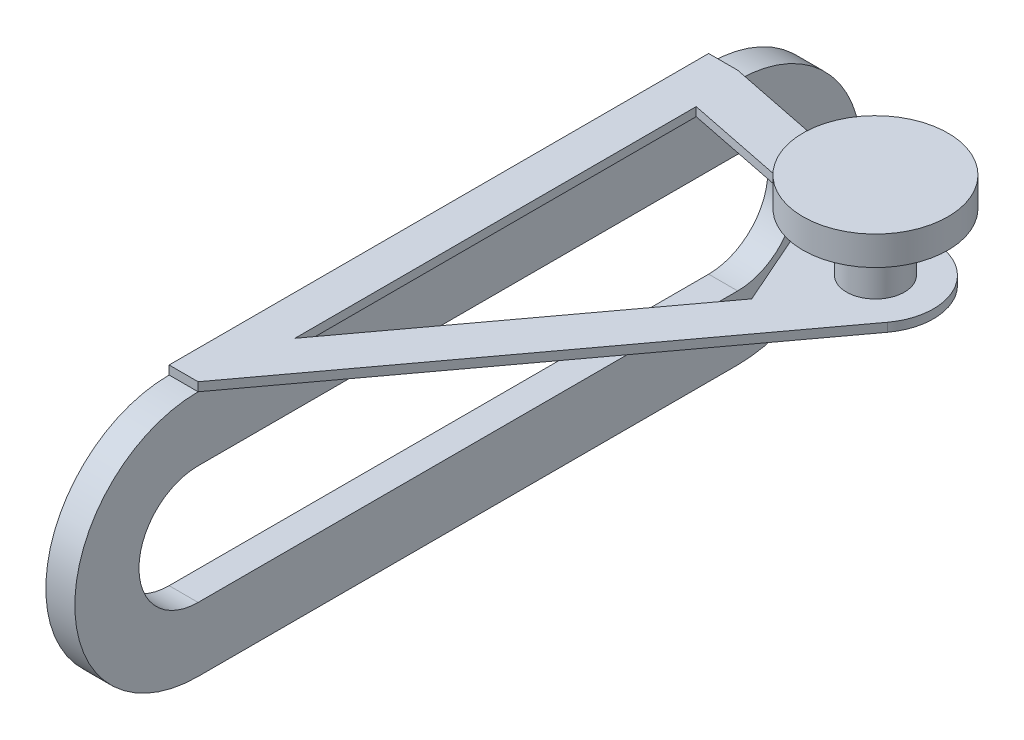
ISO-10303-21;
HEADER;
FILE_DESCRIPTION(('STEP AP214'),'2;1');
FILE_NAME('part.step','',(''),(''),'','','');
FILE_SCHEMA(('AUTOMOTIVE_DESIGN { 1 0 10303 214 1 1 1 1 }'));
ENDSEC;
DATA;
#1=APPLICATION_CONTEXT('core data for automotive mechanical design processes');
#2=APPLICATION_PROTOCOL_DEFINITION('international standard','automotive_design',2000,#1);
#3=PRODUCT_CONTEXT('',#1,'mechanical');
#4=PRODUCT('Part','Part','',(#3));
#5=PRODUCT_RELATED_PRODUCT_CATEGORY('part','',(#4));
#6=PRODUCT_DEFINITION_FORMATION('','',#4);
#7=PRODUCT_DEFINITION_CONTEXT('part definition',#1,'design');
#8=PRODUCT_DEFINITION('design','',#6,#7);
#9=PRODUCT_DEFINITION_SHAPE('','',#8);
#10=(LENGTH_UNIT() NAMED_UNIT(*) SI_UNIT(.MILLI.,.METRE.));
#11=(NAMED_UNIT(*) PLANE_ANGLE_UNIT() SI_UNIT($,.RADIAN.));
#12=(NAMED_UNIT(*) SI_UNIT($,.STERADIAN.) SOLID_ANGLE_UNIT());
#13=UNCERTAINTY_MEASURE_WITH_UNIT(LENGTH_MEASURE(1.E-05),#10,'distance_accuracy_value','');
#14=(GEOMETRIC_REPRESENTATION_CONTEXT(3) GLOBAL_UNCERTAINTY_ASSIGNED_CONTEXT((#13)) GLOBAL_UNIT_ASSIGNED_CONTEXT((#10,
#11,#12)) REPRESENTATION_CONTEXT('',''));
#15=CARTESIAN_POINT('',(0.,0.,0.));
#16=DIRECTION('',(0.,0.,1.));
#17=DIRECTION('',(1.,0.,0.));
#18=AXIS2_PLACEMENT_3D('',#15,#16,#17);
#19=CARTESIAN_POINT('',(10.,0.,186.));
#20=DIRECTION('',(-1.,0.,0.));
#21=DIRECTION('',(0.,0.,1.));
#22=AXIS2_PLACEMENT_3D('',#19,#20,#21);
#23=CYLINDRICAL_SURFACE('',#22,42.5);
#24=CARTESIAN_POINT('',(0.,0.,186.));
#25=DIRECTION('',(-1.,0.,0.));
#26=DIRECTION('',(0.,0.,1.));
#27=AXIS2_PLACEMENT_3D('',#24,#25,#26);
#28=CIRCLE('',#27,42.5);
#29=CARTESIAN_POINT('',(0.,-42.5,186.));
#30=VERTEX_POINT('',#29);
#31=CARTESIAN_POINT('',(0.,42.5,186.));
#32=VERTEX_POINT('',#31);
#33=EDGE_CURVE('E256',#30,#32,#28,.T.);
#34=ORIENTED_EDGE('',*,*,#33,.F.);
#35=DIRECTION('',(-1.,0.,0.));
#36=VECTOR('',#35,1.);
#37=CARTESIAN_POINT('',(10.,-42.5,186.));
#38=LINE('',#37,#36);
#39=CARTESIAN_POINT('',(10.,-42.5,186.));
#40=VERTEX_POINT('',#39);
#41=EDGE_CURVE('E44',#40,#30,#38,.T.);
#42=ORIENTED_EDGE('',*,*,#41,.F.);
#43=CARTESIAN_POINT('',(10.,0.,186.));
#44=DIRECTION('',(-1.,0.,0.));
#45=DIRECTION('',(0.,0.,1.));
#46=AXIS2_PLACEMENT_3D('',#43,#44,#45);
#47=CIRCLE('',#46,42.5);
#48=CARTESIAN_POINT('',(10.,42.5,186.));
#49=VERTEX_POINT('',#48);
#50=EDGE_CURVE('E257',#40,#49,#47,.T.);
#51=ORIENTED_EDGE('',*,*,#50,.T.);
#52=DIRECTION('',(-1.,0.,0.));
#53=VECTOR('',#52,1.);
#54=CARTESIAN_POINT('',(10.,42.5,186.));
#55=LINE('',#54,#53);
#56=EDGE_CURVE('E269',#49,#32,#55,.T.);
#57=ORIENTED_EDGE('',*,*,#56,.T.);
#58=EDGE_LOOP('',(#34,#42,#51,#57));
#59=FACE_BOUND('',#58,.T.);
#60=ADVANCED_FACE('F37',(#59),#23,.T.);
#61=CARTESIAN_POINT('',(10.,-42.5,0.));
#62=DIRECTION('',(0.,-1.,0.));
#63=DIRECTION('',(0.,0.,-1.));
#64=AXIS2_PLACEMENT_3D('',#61,#62,#63);
#65=PLANE('',#64);
#66=DIRECTION('',(0.,0.,1.));
#67=VECTOR('',#66,1.);
#68=CARTESIAN_POINT('',(0.,-42.5,0.));
#69=LINE('',#68,#67);
#70=CARTESIAN_POINT('',(0.,-42.5,0.));
#71=VERTEX_POINT('',#70);
#72=EDGE_CURVE('E261',#71,#30,#69,.T.);
#73=ORIENTED_EDGE('',*,*,#72,.F.);
#74=DIRECTION('',(-1.,0.,0.));
#75=VECTOR('',#74,1.);
#76=CARTESIAN_POINT('',(10.,-42.5,0.));
#77=LINE('',#76,#75);
#78=CARTESIAN_POINT('',(10.,-42.5,0.));
#79=VERTEX_POINT('',#78);
#80=EDGE_CURVE('E278',#79,#71,#77,.T.);
#81=ORIENTED_EDGE('',*,*,#80,.F.);
#82=DIRECTION('',(0.,0.,1.));
#83=VECTOR('',#82,1.);
#84=CARTESIAN_POINT('',(10.,-42.5,0.));
#85=LINE('',#84,#83);
#86=EDGE_CURVE('E266',#79,#40,#85,.T.);
#87=ORIENTED_EDGE('',*,*,#86,.T.);
#88=ORIENTED_EDGE('',*,*,#41,.T.);
#89=EDGE_LOOP('',(#73,#81,#87,#88));
#90=FACE_BOUND('',#89,.T.);
#91=ADVANCED_FACE('F294',(#90),#65,.T.);
#92=CARTESIAN_POINT('',(10.,0.,0.));
#93=DIRECTION('',(-1.,0.,0.));
#94=DIRECTION('',(0.,0.,1.));
#95=AXIS2_PLACEMENT_3D('',#92,#93,#94);
#96=CYLINDRICAL_SURFACE('',#95,42.5);
#97=CARTESIAN_POINT('',(0.,0.,0.));
#98=DIRECTION('',(-1.,0.,0.));
#99=DIRECTION('',(0.,0.,1.));
#100=AXIS2_PLACEMENT_3D('',#97,#98,#99);
#101=CIRCLE('',#100,42.5);
#102=CARTESIAN_POINT('',(0.,42.5,0.));
#103=VERTEX_POINT('',#102);
#104=EDGE_CURVE('E272',#103,#71,#101,.T.);
#105=ORIENTED_EDGE('',*,*,#104,.F.);
#106=DIRECTION('',(-1.,0.,0.));
#107=VECTOR('',#106,1.);
#108=CARTESIAN_POINT('',(10.,42.5,0.));
#109=LINE('',#108,#107);
#110=CARTESIAN_POINT('',(10.,42.5,0.));
#111=VERTEX_POINT('',#110);
#112=EDGE_CURVE('E280',#111,#103,#109,.T.);
#113=ORIENTED_EDGE('',*,*,#112,.F.);
#114=CARTESIAN_POINT('',(10.,0.,0.));
#115=DIRECTION('',(-1.,0.,0.));
#116=DIRECTION('',(0.,0.,1.));
#117=AXIS2_PLACEMENT_3D('',#114,#115,#116);
#118=CIRCLE('',#117,42.5);
#119=EDGE_CURVE('E263',#111,#79,#118,.T.);
#120=ORIENTED_EDGE('',*,*,#119,.T.);
#121=ORIENTED_EDGE('',*,*,#80,.T.);
#122=EDGE_LOOP('',(#105,#113,#120,#121));
#123=FACE_BOUND('',#122,.T.);
#124=ADVANCED_FACE('F316',(#123),#96,.T.);
#125=CARTESIAN_POINT('',(10.,0.,186.));
#126=DIRECTION('',(-1.,0.,0.));
#127=DIRECTION('',(0.,0.,1.));
#128=AXIS2_PLACEMENT_3D('',#125,#126,#127);
#129=PLANE('',#128);
#130=DIRECTION('',(0.,0.,1.));
#131=VECTOR('',#130,1.);
#132=CARTESIAN_POINT('',(10.,20.3900026725424,0.));
#133=LINE('',#132,#131);
#134=CARTESIAN_POINT('',(10.,20.3900026725424,0.));
#135=VERTEX_POINT('',#134);
#136=CARTESIAN_POINT('',(10.,20.3900026725424,186.));
#137=VERTEX_POINT('',#136);
#138=EDGE_CURVE('E200',#135,#137,#133,.T.);
#139=ORIENTED_EDGE('',*,*,#138,.F.);
#140=CARTESIAN_POINT('',(10.,0.,0.));
#141=DIRECTION('',(1.,0.,0.));
#142=DIRECTION('',(0.,0.,-1.));
#143=AXIS2_PLACEMENT_3D('',#140,#141,#142);
#144=CIRCLE('',#143,20.3900026725424);
#145=CARTESIAN_POINT('',(10.,-20.3900026725424,0.));
#146=VERTEX_POINT('',#145);
#147=EDGE_CURVE('E184',#146,#135,#144,.T.);
#148=ORIENTED_EDGE('',*,*,#147,.F.);
#149=DIRECTION('',(0.,0.,-1.));
#150=VECTOR('',#149,1.);
#151=CARTESIAN_POINT('',(10.,-20.3900026725424,186.));
#152=LINE('',#151,#150);
#153=CARTESIAN_POINT('',(10.,-20.3900026725424,186.));
#154=VERTEX_POINT('',#153);
#155=EDGE_CURVE('E189',#154,#146,#152,.T.);
#156=ORIENTED_EDGE('',*,*,#155,.F.);
#157=CARTESIAN_POINT('',(10.,0.,186.));
#158=DIRECTION('',(1.,0.,0.));
#159=DIRECTION('',(0.,0.,-1.));
#160=AXIS2_PLACEMENT_3D('',#157,#158,#159);
#161=CIRCLE('',#160,20.3900026725424);
#162=EDGE_CURVE('E203',#137,#154,#161,.T.);
#163=ORIENTED_EDGE('',*,*,#162,.F.);
#164=EDGE_LOOP('',(#139,#148,#156,#163));
#165=FACE_BOUND('',#164,.T.);
#166=ORIENTED_EDGE('',*,*,#50,.F.);
#167=ORIENTED_EDGE('',*,*,#86,.F.);
#168=ORIENTED_EDGE('',*,*,#119,.F.);
#169=DIRECTION('',(0.,0.,-1.));
#170=VECTOR('',#169,1.);
#171=CARTESIAN_POINT('',(10.,42.5,186.));
#172=LINE('',#171,#170);
#173=EDGE_CURVE('E260',#49,#111,#172,.T.);
#174=ORIENTED_EDGE('',*,*,#173,.F.);
#175=EDGE_LOOP('',(#166,#167,#168,#174));
#176=FACE_BOUND('',#175,.T.);
#177=ADVANCED_FACE('F298',(#165,#176),#129,.F.);
#178=CARTESIAN_POINT('',(0.,0.,186.));
#179=DIRECTION('',(-1.,0.,0.));
#180=DIRECTION('',(0.,0.,1.));
#181=AXIS2_PLACEMENT_3D('',#178,#179,#180);
#182=PLANE('',#181);
#183=CARTESIAN_POINT('',(0.,0.,0.));
#184=DIRECTION('',(1.,0.,0.));
#185=DIRECTION('',(0.,0.,-1.));
#186=AXIS2_PLACEMENT_3D('',#183,#184,#185);
#187=CIRCLE('',#186,20.3900026725424);
#188=CARTESIAN_POINT('',(0.,-20.3900026725424,0.));
#189=VERTEX_POINT('',#188);
#190=CARTESIAN_POINT('',(0.,20.3900026725424,0.));
#191=VERTEX_POINT('',#190);
#192=EDGE_CURVE('E185',#189,#191,#187,.T.);
#193=ORIENTED_EDGE('',*,*,#192,.T.);
#194=DIRECTION('',(0.,0.,1.));
#195=VECTOR('',#194,1.);
#196=CARTESIAN_POINT('',(0.,20.3900026725424,0.));
#197=LINE('',#196,#195);
#198=CARTESIAN_POINT('',(0.,20.3900026725424,186.));
#199=VERTEX_POINT('',#198);
#200=EDGE_CURVE('E188',#191,#199,#197,.T.);
#201=ORIENTED_EDGE('',*,*,#200,.T.);
#202=CARTESIAN_POINT('',(0.,0.,186.));
#203=DIRECTION('',(1.,0.,0.));
#204=DIRECTION('',(0.,0.,-1.));
#205=AXIS2_PLACEMENT_3D('',#202,#203,#204);
#206=CIRCLE('',#205,20.3900026725424);
#207=CARTESIAN_POINT('',(0.,-20.3900026725424,186.));
#208=VERTEX_POINT('',#207);
#209=EDGE_CURVE('E192',#199,#208,#206,.T.);
#210=ORIENTED_EDGE('',*,*,#209,.T.);
#211=DIRECTION('',(0.,0.,-1.));
#212=VECTOR('',#211,1.);
#213=CARTESIAN_POINT('',(0.,-20.3900026725424,186.));
#214=LINE('',#213,#212);
#215=EDGE_CURVE('E195',#208,#189,#214,.T.);
#216=ORIENTED_EDGE('',*,*,#215,.T.);
#217=EDGE_LOOP('',(#193,#201,#210,#216));
#218=FACE_BOUND('',#217,.T.);
#219=ORIENTED_EDGE('',*,*,#33,.T.);
#220=DIRECTION('',(0.,-1.,0.));
#221=VECTOR('',#220,1.);
#222=CARTESIAN_POINT('',(0.,45.5,186.));
#223=LINE('',#222,#221);
#224=CARTESIAN_POINT('',(0.,45.5,186.));
#225=VERTEX_POINT('',#224);
#226=EDGE_CURVE('E251',#225,#32,#223,.T.);
#227=ORIENTED_EDGE('',*,*,#226,.F.);
#228=DIRECTION('',(0.,0.,1.));
#229=VECTOR('',#228,1.);
#230=CARTESIAN_POINT('',(0.,45.5,186.));
#231=LINE('',#230,#229);
#232=CARTESIAN_POINT('',(0.,45.5,0.));
#233=VERTEX_POINT('',#232);
#234=EDGE_CURVE('E223',#233,#225,#231,.T.);
#235=ORIENTED_EDGE('',*,*,#234,.F.);
#236=DIRECTION('',(0.,-1.,0.));
#237=VECTOR('',#236,1.);
#238=CARTESIAN_POINT('',(0.,45.5,0.));
#239=LINE('',#238,#237);
#240=EDGE_CURVE('E253',#233,#103,#239,.T.);
#241=ORIENTED_EDGE('',*,*,#240,.T.);
#242=ORIENTED_EDGE('',*,*,#104,.T.);
#243=ORIENTED_EDGE('',*,*,#72,.T.);
#244=EDGE_LOOP('',(#219,#227,#235,#241,#242,#243));
#245=FACE_BOUND('',#244,.T.);
#246=ADVANCED_FACE('F289',(#218,#245),#182,.T.);
#247=CARTESIAN_POINT('',(95.,42.5,37.5));
#248=DIRECTION('',(0.,-1.,0.));
#249=DIRECTION('',(0.,0.,-1.));
#250=AXIS2_PLACEMENT_3D('',#247,#248,#249);
#251=PLANE('',#250);
#252=DIRECTION('',(0.402880786195544,0.,0.915252463593767));
#253=VECTOR('',#252,1.);
#254=CARTESIAN_POINT('',(72.564776795741,42.5,47.3756580534223));
#255=LINE('',#254,#253);
#256=CARTESIAN_POINT('',(64.1029317293349,42.5,28.1522927082754));
#257=VERTEX_POINT('',#256);
#258=CARTESIAN_POINT('',(80.693023557422,42.5,65.8411647944554));
#259=VERTEX_POINT('',#258);
#260=EDGE_CURVE('E182',#257,#259,#255,.T.);
#261=ORIENTED_EDGE('',*,*,#260,.F.);
#262=DIRECTION('',(0.980359751767151,0.,0.197217537544331));
#263=VECTOR('',#262,1.);
#264=CARTESIAN_POINT('',(95.6055904253571,42.5,34.4896364873626));
#265=LINE('',#264,#263);
#266=CARTESIAN_POINT('',(13.7159350256524,42.5,18.0160142694245));
#267=VERTEX_POINT('',#266);
#268=EDGE_CURVE('E175',#267,#257,#265,.T.);
#269=ORIENTED_EDGE('',*,*,#268,.F.);
#270=DIRECTION('',(0.,0.,-1.));
#271=VECTOR('',#270,1.);
#272=CARTESIAN_POINT('',(13.7159350256524,42.5,37.5));
#273=LINE('',#272,#271);
#274=CARTESIAN_POINT('',(13.7159350256524,42.5,156.359237722558));
#275=VERTEX_POINT('',#274);
#276=EDGE_CURVE('E155',#275,#267,#273,.T.);
#277=ORIENTED_EDGE('',*,*,#276,.F.);
#278=DIRECTION('',(-0.594806936452815,0.,0.803868588979329));
#279=VECTOR('',#278,1.);
#280=CARTESIAN_POINT('',(99.3059964076367,42.5,40.6861383399184));
#281=LINE('',#280,#279);
#282=EDGE_CURVE('E180',#259,#275,#281,.T.);
#283=ORIENTED_EDGE('',*,*,#282,.F.);
#284=EDGE_LOOP('',(#261,#269,#277,#283));
#285=FACE_BOUND('',#284,.T.);
#286=ORIENTED_EDGE('',*,*,#173,.T.);
#287=DIRECTION('',(-0.980359751767151,0.,-0.197217537544331));
#288=VECTOR('',#287,1.);
#289=CARTESIAN_POINT('',(10.,42.5,0.));
#290=LINE('',#289,#288);
#291=CARTESIAN_POINT('',(98.9443507508866,42.5,17.892804964657));
#292=VERTEX_POINT('',#291);
#293=EDGE_CURVE('E224',#292,#111,#290,.T.);
#294=ORIENTED_EDGE('',*,*,#293,.F.);
#295=CARTESIAN_POINT('',(95.,42.5,37.5));
#296=DIRECTION('',(0.,1.,0.));
#297=DIRECTION('',(0.,0.,-1.));
#298=AXIS2_PLACEMENT_3D('',#295,#296,#297);
#299=CIRCLE('',#298,20.);
#300=CARTESIAN_POINT('',(111.077371779587,42.5,49.3961387290563));
#301=VERTEX_POINT('',#300);
#302=EDGE_CURVE('E236',#301,#292,#299,.T.);
#303=ORIENTED_EDGE('',*,*,#302,.F.);
#304=DIRECTION('',(0.594806936452815,0.,-0.803868588979329));
#305=VECTOR('',#304,1.);
#306=CARTESIAN_POINT('',(111.077371779587,42.5,49.3961387290563));
#307=LINE('',#306,#305);
#308=EDGE_CURVE('E219',#49,#301,#307,.T.);
#309=ORIENTED_EDGE('',*,*,#308,.F.);
#310=EDGE_LOOP('',(#286,#294,#303,#309));
#311=FACE_BOUND('',#310,.T.);
#312=ADVANCED_FACE('F303',(#285,#311),#251,.T.);
#313=CARTESIAN_POINT('',(0.,45.5,0.));
#314=DIRECTION('',(0.,0.,1.));
#315=DIRECTION('',(1.,0.,0.));
#316=AXIS2_PLACEMENT_3D('',#313,#314,#315);
#317=PLANE('',#316);
#318=ORIENTED_EDGE('',*,*,#112,.T.);
#319=ORIENTED_EDGE('',*,*,#240,.F.);
#320=DIRECTION('',(-1.,0.,0.));
#321=VECTOR('',#320,1.);
#322=CARTESIAN_POINT('',(0.,45.5,0.));
#323=LINE('',#322,#321);
#324=CARTESIAN_POINT('',(10.,45.5,0.));
#325=VERTEX_POINT('',#324);
#326=EDGE_CURVE('E220',#325,#233,#323,.T.);
#327=ORIENTED_EDGE('',*,*,#326,.F.);
#328=DIRECTION('',(0.,-1.,0.));
#329=VECTOR('',#328,1.);
#330=CARTESIAN_POINT('',(10.,45.5,0.));
#331=LINE('',#330,#329);
#332=EDGE_CURVE('E234',#325,#111,#331,.T.);
#333=ORIENTED_EDGE('',*,*,#332,.T.);
#334=EDGE_LOOP('',(#318,#319,#327,#333));
#335=FACE_BOUND('',#334,.T.);
#336=ADVANCED_FACE('F313',(#335),#317,.F.);
#337=CARTESIAN_POINT('',(10.,45.5,186.));
#338=DIRECTION('',(0.,0.,-1.));
#339=DIRECTION('',(-1.,0.,0.));
#340=AXIS2_PLACEMENT_3D('',#337,#338,#339);
#341=PLANE('',#340);
#342=ORIENTED_EDGE('',*,*,#56,.F.);
#343=DIRECTION('',(0.,-1.,0.));
#344=VECTOR('',#343,1.);
#345=CARTESIAN_POINT('',(10.,45.5,186.));
#346=LINE('',#345,#344);
#347=CARTESIAN_POINT('',(10.,45.5,186.));
#348=VERTEX_POINT('',#347);
#349=EDGE_CURVE('E248',#348,#49,#346,.T.);
#350=ORIENTED_EDGE('',*,*,#349,.F.);
#351=DIRECTION('',(1.,0.,0.));
#352=VECTOR('',#351,1.);
#353=CARTESIAN_POINT('',(10.,45.5,186.));
#354=LINE('',#353,#352);
#355=EDGE_CURVE('E226',#225,#348,#354,.T.);
#356=ORIENTED_EDGE('',*,*,#355,.F.);
#357=ORIENTED_EDGE('',*,*,#226,.T.);
#358=EDGE_LOOP('',(#342,#350,#356,#357));
#359=FACE_BOUND('',#358,.T.);
#360=ADVANCED_FACE('F376',(#359),#341,.F.);
#361=CARTESIAN_POINT('',(111.077371779587,45.5,49.3961387290563));
#362=DIRECTION('',(-0.803868588979329,0.,-0.594806936452815));
#363=DIRECTION('',(-0.594806936452815,0.,0.803868588979329));
#364=AXIS2_PLACEMENT_3D('',#361,#362,#363);
#365=PLANE('',#364);
#366=ORIENTED_EDGE('',*,*,#308,.T.);
#367=DIRECTION('',(0.,-1.,0.));
#368=VECTOR('',#367,1.);
#369=CARTESIAN_POINT('',(111.077371779587,45.5,49.3961387290563));
#370=LINE('',#369,#368);
#371=CARTESIAN_POINT('',(111.077371779587,45.5,49.3961387290563));
#372=VERTEX_POINT('',#371);
#373=EDGE_CURVE('E245',#372,#301,#370,.T.);
#374=ORIENTED_EDGE('',*,*,#373,.F.);
#375=DIRECTION('',(0.594806936452815,0.,-0.803868588979329));
#376=VECTOR('',#375,1.);
#377=CARTESIAN_POINT('',(111.077371779587,45.5,49.3961387290563));
#378=LINE('',#377,#376);
#379=EDGE_CURVE('E228',#348,#372,#378,.T.);
#380=ORIENTED_EDGE('',*,*,#379,.F.);
#381=ORIENTED_EDGE('',*,*,#349,.T.);
#382=EDGE_LOOP('',(#366,#374,#380,#381));
#383=FACE_BOUND('',#382,.T.);
#384=ADVANCED_FACE('F384',(#383),#365,.F.);
#385=CARTESIAN_POINT('',(95.,45.5,37.5));
#386=DIRECTION('',(0.,-1.,0.));
#387=DIRECTION('',(0.,0.,-1.));
#388=AXIS2_PLACEMENT_3D('',#385,#386,#387);
#389=CYLINDRICAL_SURFACE('',#388,20.);
#390=ORIENTED_EDGE('',*,*,#302,.T.);
#391=DIRECTION('',(0.,-1.,0.));
#392=VECTOR('',#391,1.);
#393=CARTESIAN_POINT('',(98.9443507508866,45.5,17.892804964657));
#394=LINE('',#393,#392);
#395=CARTESIAN_POINT('',(98.9443507508866,45.5,17.892804964657));
#396=VERTEX_POINT('',#395);
#397=EDGE_CURVE('E242',#396,#292,#394,.T.);
#398=ORIENTED_EDGE('',*,*,#397,.F.);
#399=CARTESIAN_POINT('',(95.,45.5,37.5));
#400=DIRECTION('',(0.,1.,0.));
#401=DIRECTION('',(0.,0.,-1.));
#402=AXIS2_PLACEMENT_3D('',#399,#400,#401);
#403=CIRCLE('',#402,20.);
#404=EDGE_CURVE('E230',#372,#396,#403,.T.);
#405=ORIENTED_EDGE('',*,*,#404,.F.);
#406=ORIENTED_EDGE('',*,*,#373,.T.);
#407=EDGE_LOOP('',(#390,#398,#405,#406));
#408=FACE_BOUND('',#407,.T.);
#409=ADVANCED_FACE('F392',(#408),#389,.T.);
#410=CARTESIAN_POINT('',(10.,45.5,0.));
#411=DIRECTION('',(-0.197217537544331,0.,0.980359751767151));
#412=DIRECTION('',(0.980359751767151,0.,0.197217537544331));
#413=AXIS2_PLACEMENT_3D('',#410,#411,#412);
#414=PLANE('',#413);
#415=ORIENTED_EDGE('',*,*,#293,.T.);
#416=ORIENTED_EDGE('',*,*,#332,.F.);
#417=DIRECTION('',(-0.980359751767151,0.,-0.197217537544331));
#418=VECTOR('',#417,1.);
#419=CARTESIAN_POINT('',(10.,45.5,0.));
#420=LINE('',#419,#418);
#421=EDGE_CURVE('E232',#396,#325,#420,.T.);
#422=ORIENTED_EDGE('',*,*,#421,.F.);
#423=ORIENTED_EDGE('',*,*,#397,.T.);
#424=EDGE_LOOP('',(#415,#416,#422,#423));
#425=FACE_BOUND('',#424,.T.);
#426=ADVANCED_FACE('F307',(#425),#414,.F.);
#427=CARTESIAN_POINT('',(95.,45.5,37.5));
#428=DIRECTION('',(0.,-1.,0.));
#429=DIRECTION('',(0.,0.,-1.));
#430=AXIS2_PLACEMENT_3D('',#427,#428,#429);
#431=PLANE('',#430);
#432=DIRECTION('',(-0.980359751767151,0.,-0.197217537544331));
#433=VECTOR('',#432,1.);
#434=CARTESIAN_POINT('',(64.1029317293349,45.5,28.1522927082754));
#435=LINE('',#434,#433);
#436=CARTESIAN_POINT('',(64.1029317293349,45.5,28.1522927082754));
#437=VERTEX_POINT('',#436);
#438=CARTESIAN_POINT('',(13.7159350256524,45.5,18.0160142694245));
#439=VERTEX_POINT('',#438);
#440=EDGE_CURVE('E161',#437,#439,#435,.T.);
#441=ORIENTED_EDGE('',*,*,#440,.F.);
#442=DIRECTION('',(-0.402880786195544,0.,-0.915252463593767));
#443=VECTOR('',#442,1.);
#444=CARTESIAN_POINT('',(80.693023557422,45.5,65.8411647944554));
#445=LINE('',#444,#443);
#446=CARTESIAN_POINT('',(80.693023557422,45.5,65.8411647944554));
#447=VERTEX_POINT('',#446);
#448=EDGE_CURVE('E59',#447,#437,#445,.T.);
#449=ORIENTED_EDGE('',*,*,#448,.F.);
#450=DIRECTION('',(0.594806936452815,0.,-0.803868588979329));
#451=VECTOR('',#450,1.);
#452=CARTESIAN_POINT('',(13.7159350256524,45.5,156.359237722558));
#453=LINE('',#452,#451);
#454=CARTESIAN_POINT('',(13.7159350256524,45.5,156.359237722558));
#455=VERTEX_POINT('',#454);
#456=EDGE_CURVE('E168',#455,#447,#453,.T.);
#457=ORIENTED_EDGE('',*,*,#456,.F.);
#458=DIRECTION('',(0.,0.,1.));
#459=VECTOR('',#458,1.);
#460=CARTESIAN_POINT('',(13.7159350256524,45.5,18.0160142694245));
#461=LINE('',#460,#459);
#462=EDGE_CURVE('E152',#439,#455,#461,.T.);
#463=ORIENTED_EDGE('',*,*,#462,.F.);
#464=EDGE_LOOP('',(#441,#449,#457,#463));
#465=FACE_BOUND('',#464,.T.);
#466=CARTESIAN_POINT('',(95.,45.5,37.5));
#467=DIRECTION('',(0.,-1.,0.));
#468=DIRECTION('',(0.,0.,-1.));
#469=AXIS2_PLACEMENT_3D('',#466,#467,#468);
#470=CIRCLE('',#469,9.99999999999999);
#471=CARTESIAN_POINT('',(95.,45.5,27.5));
#472=VERTEX_POINT('',#471);
#473=EDGE_CURVE('E11',#472,#472,#470,.F.);
#474=ORIENTED_EDGE('',*,*,#473,.F.);
#475=EDGE_LOOP('',(#474));
#476=FACE_BOUND('',#475,.T.);
#477=ORIENTED_EDGE('',*,*,#326,.T.);
#478=ORIENTED_EDGE('',*,*,#234,.T.);
#479=ORIENTED_EDGE('',*,*,#355,.T.);
#480=ORIENTED_EDGE('',*,*,#379,.T.);
#481=ORIENTED_EDGE('',*,*,#404,.T.);
#482=ORIENTED_EDGE('',*,*,#421,.T.);
#483=EDGE_LOOP('',(#477,#478,#479,#480,#481,#482));
#484=FACE_BOUND('',#483,.T.);
#485=ADVANCED_FACE('F165',(#465,#476,#484),#431,.F.);
#486=CARTESIAN_POINT('',(95.,65.5,37.5));
#487=DIRECTION('',(0.,-1.,0.));
#488=DIRECTION('',(0.,0.,-1.));
#489=AXIS2_PLACEMENT_3D('',#486,#487,#488);
#490=CYLINDRICAL_SURFACE('',#489,9.99999999999999);
#491=CARTESIAN_POINT('',(95.,65.5,37.5));
#492=DIRECTION('',(0.,1.,0.));
#493=DIRECTION('',(0.,0.,1.));
#494=AXIS2_PLACEMENT_3D('',#491,#492,#493);
#495=CIRCLE('',#494,9.99999999999999);
#496=CARTESIAN_POINT('',(95.,65.5,47.5));
#497=VERTEX_POINT('',#496);
#498=EDGE_CURVE('E210',#497,#497,#495,.T.);
#499=ORIENTED_EDGE('',*,*,#498,.F.);
#500=EDGE_LOOP('',(#499));
#501=FACE_BOUND('',#500,.T.);
#502=ORIENTED_EDGE('',*,*,#473,.T.);
#503=EDGE_LOOP('',(#502));
#504=FACE_BOUND('',#503,.T.);
#505=ADVANCED_FACE('F415',(#501,#504),#490,.T.);
#506=CARTESIAN_POINT('',(0.,0.,0.));
#507=DIRECTION('',(1.,0.,0.));
#508=DIRECTION('',(0.,0.,-1.));
#509=AXIS2_PLACEMENT_3D('',#506,#507,#508);
#510=CYLINDRICAL_SURFACE('',#509,20.3900026725424);
#511=ORIENTED_EDGE('',*,*,#147,.T.);
#512=DIRECTION('',(1.,0.,0.));
#513=VECTOR('',#512,1.);
#514=CARTESIAN_POINT('',(0.,20.3900026725424,0.));
#515=LINE('',#514,#513);
#516=EDGE_CURVE('E198',#191,#135,#515,.T.);
#517=ORIENTED_EDGE('',*,*,#516,.F.);
#518=ORIENTED_EDGE('',*,*,#192,.F.);
#519=DIRECTION('',(1.,0.,0.));
#520=VECTOR('',#519,1.);
#521=CARTESIAN_POINT('',(0.,-20.3900026725424,0.));
#522=LINE('',#521,#520);
#523=EDGE_CURVE('E208',#189,#146,#522,.T.);
#524=ORIENTED_EDGE('',*,*,#523,.T.);
#525=EDGE_LOOP('',(#511,#517,#518,#524));
#526=FACE_BOUND('',#525,.T.);
#527=ADVANCED_FACE('F423',(#526),#510,.F.);
#528=CARTESIAN_POINT('',(0.,-20.3900026725424,186.));
#529=DIRECTION('',(0.,-1.,0.));
#530=DIRECTION('',(0.,0.,-1.));
#531=AXIS2_PLACEMENT_3D('',#528,#529,#530);
#532=PLANE('',#531);
#533=ORIENTED_EDGE('',*,*,#155,.T.);
#534=ORIENTED_EDGE('',*,*,#523,.F.);
#535=ORIENTED_EDGE('',*,*,#215,.F.);
#536=DIRECTION('',(1.,0.,0.));
#537=VECTOR('',#536,1.);
#538=CARTESIAN_POINT('',(0.,-20.3900026725424,186.));
#539=LINE('',#538,#537);
#540=EDGE_CURVE('E211',#208,#154,#539,.T.);
#541=ORIENTED_EDGE('',*,*,#540,.T.);
#542=EDGE_LOOP('',(#533,#534,#535,#541));
#543=FACE_BOUND('',#542,.T.);
#544=ADVANCED_FACE('F431',(#543),#532,.F.);
#545=CARTESIAN_POINT('',(0.,0.,186.));
#546=DIRECTION('',(1.,0.,0.));
#547=DIRECTION('',(0.,0.,-1.));
#548=AXIS2_PLACEMENT_3D('',#545,#546,#547);
#549=CYLINDRICAL_SURFACE('',#548,20.3900026725424);
#550=ORIENTED_EDGE('',*,*,#162,.T.);
#551=ORIENTED_EDGE('',*,*,#540,.F.);
#552=ORIENTED_EDGE('',*,*,#209,.F.);
#553=DIRECTION('',(1.,0.,0.));
#554=VECTOR('',#553,1.);
#555=CARTESIAN_POINT('',(0.,20.3900026725424,186.));
#556=LINE('',#555,#554);
#557=EDGE_CURVE('E213',#199,#137,#556,.T.);
#558=ORIENTED_EDGE('',*,*,#557,.T.);
#559=EDGE_LOOP('',(#550,#551,#552,#558));
#560=FACE_BOUND('',#559,.T.);
#561=ADVANCED_FACE('F440',(#560),#549,.F.);
#562=CARTESIAN_POINT('',(0.,20.3900026725424,0.));
#563=DIRECTION('',(0.,1.,0.));
#564=DIRECTION('',(0.,0.,1.));
#565=AXIS2_PLACEMENT_3D('',#562,#563,#564);
#566=PLANE('',#565);
#567=ORIENTED_EDGE('',*,*,#138,.T.);
#568=ORIENTED_EDGE('',*,*,#557,.F.);
#569=ORIENTED_EDGE('',*,*,#200,.F.);
#570=ORIENTED_EDGE('',*,*,#516,.T.);
#571=EDGE_LOOP('',(#567,#568,#569,#570));
#572=FACE_BOUND('',#571,.T.);
#573=ADVANCED_FACE('F449',(#572),#566,.F.);
#574=CARTESIAN_POINT('',(80.693023557422,-42.5,65.8411647944554));
#575=DIRECTION('',(0.915252463593767,0.,-0.402880786195544));
#576=DIRECTION('',(-0.402880786195544,0.,-0.915252463593767));
#577=AXIS2_PLACEMENT_3D('',#574,#575,#576);
#578=PLANE('',#577);
#579=ORIENTED_EDGE('',*,*,#260,.T.);
#580=DIRECTION('',(0.,1.,0.));
#581=VECTOR('',#580,1.);
#582=CARTESIAN_POINT('',(80.693023557422,-42.5,65.8411647944554));
#583=LINE('',#582,#581);
#584=EDGE_CURVE('E173',#259,#447,#583,.T.);
#585=ORIENTED_EDGE('',*,*,#584,.T.);
#586=ORIENTED_EDGE('',*,*,#448,.T.);
#587=DIRECTION('',(0.,1.,0.));
#588=VECTOR('',#587,1.);
#589=CARTESIAN_POINT('',(64.1029317293349,-42.5,28.1522927082754));
#590=LINE('',#589,#588);
#591=EDGE_CURVE('E158',#257,#437,#590,.T.);
#592=ORIENTED_EDGE('',*,*,#591,.F.);
#593=EDGE_LOOP('',(#579,#585,#586,#592));
#594=FACE_BOUND('',#593,.T.);
#595=ADVANCED_FACE('F457',(#594),#578,.F.);
#596=CARTESIAN_POINT('',(13.7159350256524,-42.5,156.359237722558));
#597=DIRECTION('',(0.803868588979329,0.,0.594806936452815));
#598=DIRECTION('',(0.594806936452815,0.,-0.803868588979329));
#599=AXIS2_PLACEMENT_3D('',#596,#597,#598);
#600=PLANE('',#599);
#601=ORIENTED_EDGE('',*,*,#282,.T.);
#602=DIRECTION('',(0.,1.,0.));
#603=VECTOR('',#602,1.);
#604=CARTESIAN_POINT('',(13.7159350256524,-42.5,156.359237722558));
#605=LINE('',#604,#603);
#606=EDGE_CURVE('E157',#275,#455,#605,.T.);
#607=ORIENTED_EDGE('',*,*,#606,.T.);
#608=ORIENTED_EDGE('',*,*,#456,.T.);
#609=ORIENTED_EDGE('',*,*,#584,.F.);
#610=EDGE_LOOP('',(#601,#607,#608,#609));
#611=FACE_BOUND('',#610,.T.);
#612=ADVANCED_FACE('F465',(#611),#600,.F.);
#613=CARTESIAN_POINT('',(13.7159350256524,-42.5,18.0160142694245));
#614=DIRECTION('',(-1.,0.,0.));
#615=DIRECTION('',(0.,0.,1.));
#616=AXIS2_PLACEMENT_3D('',#613,#614,#615);
#617=PLANE('',#616);
#618=ORIENTED_EDGE('',*,*,#276,.T.);
#619=DIRECTION('',(0.,1.,0.));
#620=VECTOR('',#619,1.);
#621=CARTESIAN_POINT('',(13.7159350256524,-42.5,18.0160142694245));
#622=LINE('',#621,#620);
#623=EDGE_CURVE('E51',#267,#439,#622,.T.);
#624=ORIENTED_EDGE('',*,*,#623,.T.);
#625=ORIENTED_EDGE('',*,*,#462,.T.);
#626=ORIENTED_EDGE('',*,*,#606,.F.);
#627=EDGE_LOOP('',(#618,#624,#625,#626));
#628=FACE_BOUND('',#627,.T.);
#629=ADVANCED_FACE('F149',(#628),#617,.F.);
#630=CARTESIAN_POINT('',(64.1029317293349,-42.5,28.1522927082754));
#631=DIRECTION('',(0.197217537544331,0.,-0.980359751767151));
#632=DIRECTION('',(-0.980359751767151,0.,-0.197217537544331));
#633=AXIS2_PLACEMENT_3D('',#630,#631,#632);
#634=PLANE('',#633);
#635=ORIENTED_EDGE('',*,*,#268,.T.);
#636=ORIENTED_EDGE('',*,*,#591,.T.);
#637=ORIENTED_EDGE('',*,*,#440,.T.);
#638=ORIENTED_EDGE('',*,*,#623,.F.);
#639=EDGE_LOOP('',(#635,#636,#637,#638));
#640=FACE_BOUND('',#639,.T.);
#641=ADVANCED_FACE('F162',(#640),#634,.F.);
#642=CARTESIAN_POINT('',(95.,75.5,37.5));
#643=DIRECTION('',(0.,-1.,0.));
#644=DIRECTION('',(0.,0.,-1.));
#645=AXIS2_PLACEMENT_3D('',#642,#643,#644);
#646=CYLINDRICAL_SURFACE('',#645,25.);
#647=CARTESIAN_POINT('',(95.,75.5,37.5));
#648=DIRECTION('',(0.,1.,0.));
#649=DIRECTION('',(0.,0.,1.));
#650=AXIS2_PLACEMENT_3D('',#647,#648,#649);
#651=CIRCLE('',#650,25.);
#652=CARTESIAN_POINT('',(95.,75.5,62.5));
#653=VERTEX_POINT('',#652);
#654=EDGE_CURVE('E543',#653,#653,#651,.T.);
#655=ORIENTED_EDGE('',*,*,#654,.F.);
#656=EDGE_LOOP('',(#655));
#657=FACE_BOUND('',#656,.T.);
#658=CARTESIAN_POINT('',(95.,65.5,37.5));
#659=DIRECTION('',(0.,1.,0.));
#660=DIRECTION('',(0.,0.,1.));
#661=AXIS2_PLACEMENT_3D('',#658,#659,#660);
#662=CIRCLE('',#661,25.);
#663=CARTESIAN_POINT('',(95.,65.5,62.5));
#664=VERTEX_POINT('',#663);
#665=EDGE_CURVE('E541',#664,#664,#662,.T.);
#666=ORIENTED_EDGE('',*,*,#665,.T.);
#667=EDGE_LOOP('',(#666));
#668=FACE_BOUND('',#667,.T.);
#669=ADVANCED_FACE('F488',(#657,#668),#646,.T.);
#670=CARTESIAN_POINT('',(95.,75.5,37.5));
#671=DIRECTION('',(0.,1.,0.));
#672=DIRECTION('',(0.,0.,1.));
#673=AXIS2_PLACEMENT_3D('',#670,#671,#672);
#674=PLANE('',#673);
#675=ORIENTED_EDGE('',*,*,#654,.T.);
#676=EDGE_LOOP('',(#675));
#677=FACE_BOUND('',#676,.T.);
#678=ADVANCED_FACE('F496',(#677),#674,.T.);
#679=CARTESIAN_POINT('',(95.,65.5,37.5));
#680=DIRECTION('',(0.,1.,0.));
#681=DIRECTION('',(0.,0.,1.));
#682=AXIS2_PLACEMENT_3D('',#679,#680,#681);
#683=PLANE('',#682);
#684=ORIENTED_EDGE('',*,*,#498,.T.);
#685=EDGE_LOOP('',(#684));
#686=FACE_BOUND('',#685,.T.);
#687=ORIENTED_EDGE('',*,*,#665,.F.);
#688=EDGE_LOOP('',(#687));
#689=FACE_BOUND('',#688,.T.);
#690=ADVANCED_FACE('F505',(#686,#689),#683,.F.);
#691=CLOSED_SHELL('',(#60,#91,#124,#177,#246,#312,#336,#360,#384,#409,#426,#485,#505,#527,#544,
#561,#573,#595,#612,#629,#641,#669,#678,#690));
#692=MANIFOLD_SOLID_BREP('B2',#691);
#693=ADVANCED_BREP_SHAPE_REPRESENTATION('',(#18,#692),#14);
#694=SHAPE_DEFINITION_REPRESENTATION(#9,#693);
ENDSEC;
END-ISO-10303-21;
